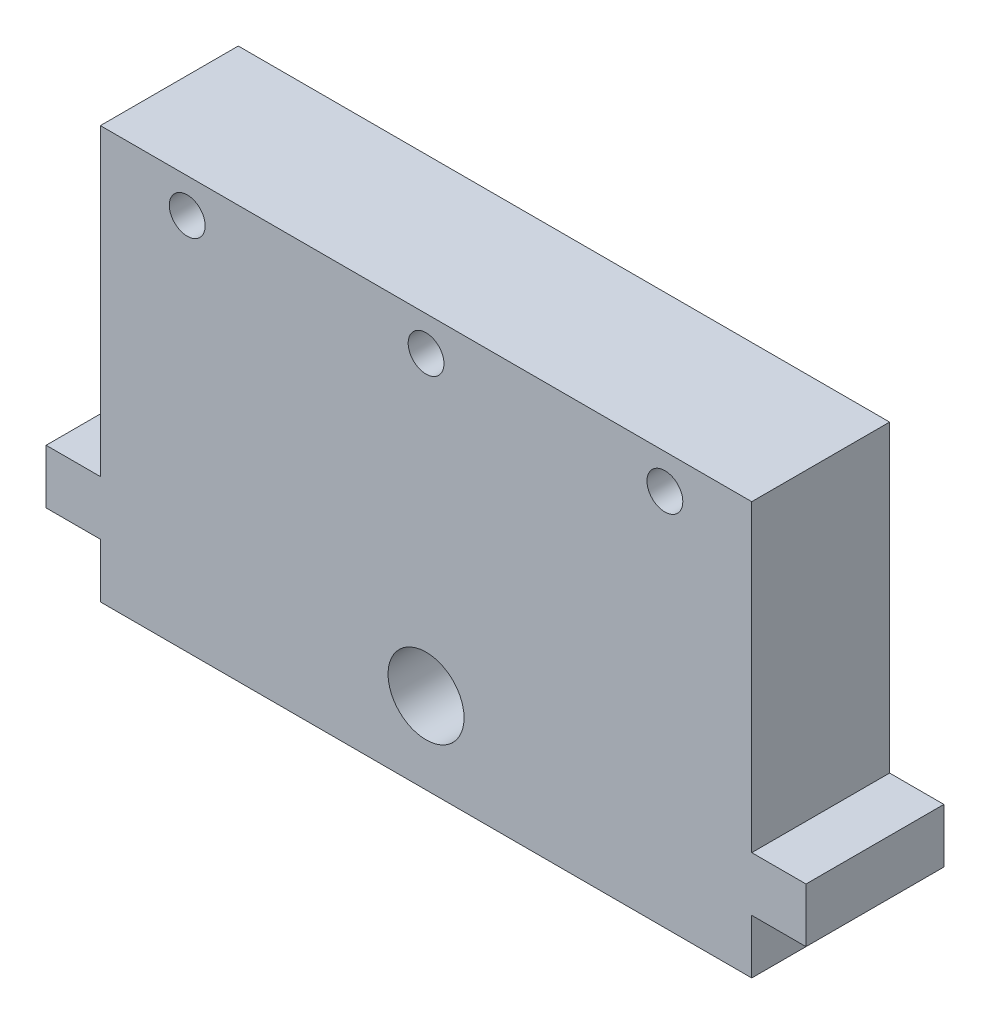
ISO-10303-21;
HEADER;
FILE_DESCRIPTION(('STEP AP214'),'2;1');
FILE_NAME('part.step','',(''),(''),'','','');
FILE_SCHEMA(('AUTOMOTIVE_DESIGN { 1 0 10303 214 1 1 1 1 }'));
ENDSEC;
DATA;
#1=APPLICATION_CONTEXT('core data for automotive mechanical design processes');
#2=APPLICATION_PROTOCOL_DEFINITION('international standard','automotive_design',2000,#1);
#3=PRODUCT_CONTEXT('',#1,'mechanical');
#4=PRODUCT('Part','Part','',(#3));
#5=PRODUCT_RELATED_PRODUCT_CATEGORY('part','',(#4));
#6=PRODUCT_DEFINITION_FORMATION('','',#4);
#7=PRODUCT_DEFINITION_CONTEXT('part definition',#1,'design');
#8=PRODUCT_DEFINITION('design','',#6,#7);
#9=PRODUCT_DEFINITION_SHAPE('','',#8);
#10=(LENGTH_UNIT() NAMED_UNIT(*) SI_UNIT(.MILLI.,.METRE.));
#11=(NAMED_UNIT(*) PLANE_ANGLE_UNIT() SI_UNIT($,.RADIAN.));
#12=(NAMED_UNIT(*) SI_UNIT($,.STERADIAN.) SOLID_ANGLE_UNIT());
#13=UNCERTAINTY_MEASURE_WITH_UNIT(LENGTH_MEASURE(1.E-05),#10,'distance_accuracy_value','');
#14=(GEOMETRIC_REPRESENTATION_CONTEXT(3) GLOBAL_UNCERTAINTY_ASSIGNED_CONTEXT((#13)) GLOBAL_UNIT_ASSIGNED_CONTEXT((#10,
#11,#12)) REPRESENTATION_CONTEXT('',''));
#15=CARTESIAN_POINT('',(0.,0.,0.));
#16=DIRECTION('',(0.,0.,1.));
#17=DIRECTION('',(1.,0.,0.));
#18=AXIS2_PLACEMENT_3D('',#15,#16,#17);
#19=CARTESIAN_POINT('',(0.,38.,0.));
#20=DIRECTION('',(-1.,0.,0.));
#21=DIRECTION('',(0.,0.,1.));
#22=AXIS2_PLACEMENT_3D('',#19,#20,#21);
#23=PLANE('',#22);
#24=DIRECTION('',(0.,0.,1.));
#25=VECTOR('',#24,1.);
#26=CARTESIAN_POINT('',(0.,10.,-12.7));
#27=LINE('',#26,#25);
#28=CARTESIAN_POINT('',(0.,10.,-12.7));
#29=VERTEX_POINT('',#28);
#30=CARTESIAN_POINT('',(0.,10.,0.));
#31=VERTEX_POINT('',#30);
#32=EDGE_CURVE('E142',#29,#31,#27,.T.);
#33=ORIENTED_EDGE('',*,*,#32,.F.);
#34=DIRECTION('',(0.,-1.,0.));
#35=VECTOR('',#34,1.);
#36=CARTESIAN_POINT('',(0.,38.,-12.7));
#37=LINE('',#36,#35);
#38=CARTESIAN_POINT('',(0.,38.,-12.7));
#39=VERTEX_POINT('',#38);
#40=EDGE_CURVE('E11',#39,#29,#37,.T.);
#41=ORIENTED_EDGE('',*,*,#40,.F.);
#42=DIRECTION('',(0.,0.,-1.));
#43=VECTOR('',#42,1.);
#44=CARTESIAN_POINT('',(0.,38.,0.));
#45=LINE('',#44,#43);
#46=CARTESIAN_POINT('',(0.,38.,0.));
#47=VERTEX_POINT('',#46);
#48=EDGE_CURVE('E221',#47,#39,#45,.T.);
#49=ORIENTED_EDGE('',*,*,#48,.F.);
#50=DIRECTION('',(0.,-1.,0.));
#51=VECTOR('',#50,1.);
#52=CARTESIAN_POINT('',(0.,38.,0.));
#53=LINE('',#52,#51);
#54=EDGE_CURVE('E249',#47,#31,#53,.T.);
#55=ORIENTED_EDGE('',*,*,#54,.T.);
#56=EDGE_LOOP('',(#33,#41,#49,#55));
#57=FACE_BOUND('',#56,.T.);
#58=ADVANCED_FACE('F41',(#57),#23,.F.);
#59=CARTESIAN_POINT('',(-60.,38.,0.));
#60=DIRECTION('',(1.,0.,0.));
#61=DIRECTION('',(0.,0.,-1.));
#62=AXIS2_PLACEMENT_3D('',#59,#60,#61);
#63=PLANE('',#62);
#64=DIRECTION('',(0.,0.,1.));
#65=VECTOR('',#64,1.);
#66=CARTESIAN_POINT('',(-60.,5.,-12.7));
#67=LINE('',#66,#65);
#68=CARTESIAN_POINT('',(-60.,5.,-12.7));
#69=VERTEX_POINT('',#68);
#70=CARTESIAN_POINT('',(-60.,5.,0.));
#71=VERTEX_POINT('',#70);
#72=EDGE_CURVE('E201',#69,#71,#67,.T.);
#73=ORIENTED_EDGE('',*,*,#72,.F.);
#74=DIRECTION('',(0.,-1.,0.));
#75=VECTOR('',#74,1.);
#76=CARTESIAN_POINT('',(-60.,38.,-12.7));
#77=LINE('',#76,#75);
#78=CARTESIAN_POINT('',(-60.,0.,-12.7));
#79=VERTEX_POINT('',#78);
#80=EDGE_CURVE('E257',#69,#79,#77,.T.);
#81=ORIENTED_EDGE('',*,*,#80,.T.);
#82=DIRECTION('',(0.,0.,1.));
#83=VECTOR('',#82,1.);
#84=CARTESIAN_POINT('',(-60.,0.,0.));
#85=LINE('',#84,#83);
#86=CARTESIAN_POINT('',(-60.,0.,0.));
#87=VERTEX_POINT('',#86);
#88=EDGE_CURVE('E242',#79,#87,#85,.T.);
#89=ORIENTED_EDGE('',*,*,#88,.T.);
#90=DIRECTION('',(0.,-1.,0.));
#91=VECTOR('',#90,1.);
#92=CARTESIAN_POINT('',(-60.,38.,0.));
#93=LINE('',#92,#91);
#94=EDGE_CURVE('E253',#71,#87,#93,.T.);
#95=ORIENTED_EDGE('',*,*,#94,.F.);
#96=EDGE_LOOP('',(#73,#81,#89,#95));
#97=FACE_BOUND('',#96,.T.);
#98=ADVANCED_FACE('F269',(#97),#63,.F.);
#99=CARTESIAN_POINT('',(0.,5.,-12.7));
#100=VERTEX_POINT('',#99);
#101=CARTESIAN_POINT('',(0.,0.,-12.7));
#102=VERTEX_POINT('',#101);
#103=EDGE_CURVE('E50',#100,#102,#37,.T.);
#104=ORIENTED_EDGE('',*,*,#103,.F.);
#105=DIRECTION('',(0.,0.,1.));
#106=VECTOR('',#105,1.);
#107=CARTESIAN_POINT('',(0.,5.,-12.7));
#108=LINE('',#107,#106);
#109=CARTESIAN_POINT('',(0.,5.,0.));
#110=VERTEX_POINT('',#109);
#111=EDGE_CURVE('E174',#100,#110,#108,.T.);
#112=ORIENTED_EDGE('',*,*,#111,.T.);
#113=CARTESIAN_POINT('',(0.,0.,0.));
#114=VERTEX_POINT('',#113);
#115=EDGE_CURVE('E235',#110,#114,#53,.T.);
#116=ORIENTED_EDGE('',*,*,#115,.T.);
#117=DIRECTION('',(0.,0.,-1.));
#118=VECTOR('',#117,1.);
#119=CARTESIAN_POINT('',(0.,0.,0.));
#120=LINE('',#119,#118);
#121=EDGE_CURVE('E220',#114,#102,#120,.T.);
#122=ORIENTED_EDGE('',*,*,#121,.T.);
#123=EDGE_LOOP('',(#104,#112,#116,#122));
#124=FACE_BOUND('',#123,.T.);
#125=ADVANCED_FACE('F43',(#124),#23,.F.);
#126=CARTESIAN_POINT('',(0.,38.,-12.7));
#127=DIRECTION('',(0.,0.,1.));
#128=DIRECTION('',(1.,0.,0.));
#129=AXIS2_PLACEMENT_3D('',#126,#127,#128);
#130=PLANE('',#129);
#131=CARTESIAN_POINT('',(-52.,34.825,-12.7));
#132=DIRECTION('',(0.,0.,1.));
#133=DIRECTION('',(1.,0.,0.));
#134=AXIS2_PLACEMENT_3D('',#131,#132,#133);
#135=CIRCLE('',#134,1.65);
#136=CARTESIAN_POINT('',(-50.35,34.825,-12.7));
#137=VERTEX_POINT('',#136);
#138=EDGE_CURVE('E363',#137,#137,#135,.T.);
#139=ORIENTED_EDGE('',*,*,#138,.T.);
#140=EDGE_LOOP('',(#139));
#141=FACE_BOUND('',#140,.T.);
#142=CARTESIAN_POINT('',(-30.,34.825,-12.7));
#143=DIRECTION('',(0.,0.,1.));
#144=DIRECTION('',(1.,0.,0.));
#145=AXIS2_PLACEMENT_3D('',#142,#143,#144);
#146=CIRCLE('',#145,1.65);
#147=CARTESIAN_POINT('',(-28.35,34.825,-12.7));
#148=VERTEX_POINT('',#147);
#149=EDGE_CURVE('E376',#148,#148,#146,.T.);
#150=ORIENTED_EDGE('',*,*,#149,.T.);
#151=EDGE_LOOP('',(#150));
#152=FACE_BOUND('',#151,.T.);
#153=CARTESIAN_POINT('',(-8.,34.825,-12.7));
#154=DIRECTION('',(0.,0.,1.));
#155=DIRECTION('',(1.,0.,0.));
#156=AXIS2_PLACEMENT_3D('',#153,#154,#155);
#157=CIRCLE('',#156,1.65);
#158=CARTESIAN_POINT('',(-6.35,34.825,-12.7));
#159=VERTEX_POINT('',#158);
#160=EDGE_CURVE('E162',#159,#159,#157,.T.);
#161=ORIENTED_EDGE('',*,*,#160,.T.);
#162=EDGE_LOOP('',(#161));
#163=FACE_BOUND('',#162,.T.);
#164=CARTESIAN_POINT('',(-30.,7.5,-12.7));
#165=DIRECTION('',(0.,0.,1.));
#166=DIRECTION('',(1.,0.,0.));
#167=AXIS2_PLACEMENT_3D('',#164,#165,#166);
#168=CIRCLE('',#167,3.5);
#169=CARTESIAN_POINT('',(-26.5,7.5,-12.7));
#170=VERTEX_POINT('',#169);
#171=EDGE_CURVE('E216',#170,#170,#168,.T.);
#172=ORIENTED_EDGE('',*,*,#171,.T.);
#173=EDGE_LOOP('',(#172));
#174=FACE_BOUND('',#173,.T.);
#175=DIRECTION('',(-1.,0.,0.));
#176=VECTOR('',#175,1.);
#177=CARTESIAN_POINT('',(0.,0.,-12.7));
#178=LINE('',#177,#176);
#179=EDGE_CURVE('E239',#102,#79,#178,.T.);
#180=ORIENTED_EDGE('',*,*,#179,.T.);
#181=ORIENTED_EDGE('',*,*,#80,.F.);
#182=DIRECTION('',(1.,0.,0.));
#183=VECTOR('',#182,1.);
#184=CARTESIAN_POINT('',(-65.,5.,-12.7));
#185=LINE('',#184,#183);
#186=CARTESIAN_POINT('',(-65.,5.,-12.7));
#187=VERTEX_POINT('',#186);
#188=EDGE_CURVE('E188',#187,#69,#185,.T.);
#189=ORIENTED_EDGE('',*,*,#188,.F.);
#190=DIRECTION('',(0.,-1.,0.));
#191=VECTOR('',#190,1.);
#192=CARTESIAN_POINT('',(-65.,10.,-12.7));
#193=LINE('',#192,#191);
#194=CARTESIAN_POINT('',(-65.,10.,-12.7));
#195=VERTEX_POINT('',#194);
#196=EDGE_CURVE('E183',#195,#187,#193,.T.);
#197=ORIENTED_EDGE('',*,*,#196,.F.);
#198=DIRECTION('',(-1.,0.,0.));
#199=VECTOR('',#198,1.);
#200=CARTESIAN_POINT('',(-60.,10.,-12.7));
#201=LINE('',#200,#199);
#202=CARTESIAN_POINT('',(-60.,10.,-12.7));
#203=VERTEX_POINT('',#202);
#204=EDGE_CURVE('E179',#203,#195,#201,.T.);
#205=ORIENTED_EDGE('',*,*,#204,.F.);
#206=CARTESIAN_POINT('',(-60.,38.,-12.7));
#207=VERTEX_POINT('',#206);
#208=EDGE_CURVE('E258',#207,#203,#77,.T.);
#209=ORIENTED_EDGE('',*,*,#208,.F.);
#210=DIRECTION('',(-1.,0.,0.));
#211=VECTOR('',#210,1.);
#212=CARTESIAN_POINT('',(0.,38.,-12.7));
#213=LINE('',#212,#211);
#214=EDGE_CURVE('E225',#39,#207,#213,.T.);
#215=ORIENTED_EDGE('',*,*,#214,.F.);
#216=ORIENTED_EDGE('',*,*,#40,.T.);
#217=DIRECTION('',(-1.,0.,0.));
#218=VECTOR('',#217,1.);
#219=CARTESIAN_POINT('',(0.,10.,-12.7));
#220=LINE('',#219,#218);
#221=CARTESIAN_POINT('',(5.,10.,-12.7));
#222=VERTEX_POINT('',#221);
#223=EDGE_CURVE('E133',#222,#29,#220,.T.);
#224=ORIENTED_EDGE('',*,*,#223,.F.);
#225=DIRECTION('',(0.,1.,0.));
#226=VECTOR('',#225,1.);
#227=CARTESIAN_POINT('',(5.,10.,-12.7));
#228=LINE('',#227,#226);
#229=CARTESIAN_POINT('',(5.,5.,-12.7));
#230=VERTEX_POINT('',#229);
#231=EDGE_CURVE('E150',#230,#222,#228,.T.);
#232=ORIENTED_EDGE('',*,*,#231,.F.);
#233=DIRECTION('',(1.,0.,0.));
#234=VECTOR('',#233,1.);
#235=CARTESIAN_POINT('',(5.,5.,-12.7));
#236=LINE('',#235,#234);
#237=EDGE_CURVE('E143',#100,#230,#236,.T.);
#238=ORIENTED_EDGE('',*,*,#237,.F.);
#239=ORIENTED_EDGE('',*,*,#103,.T.);
#240=EDGE_LOOP('',(#180,#181,#189,#197,#205,#209,#215,#216,#224,#232,#238,#239));
#241=FACE_BOUND('',#240,.T.);
#242=ADVANCED_FACE('F148',(#141,#152,#163,#174,#241),#130,.F.);
#243=ORIENTED_EDGE('',*,*,#208,.T.);
#244=DIRECTION('',(0.,0.,1.));
#245=VECTOR('',#244,1.);
#246=CARTESIAN_POINT('',(-60.,10.,-12.7));
#247=LINE('',#246,#245);
#248=CARTESIAN_POINT('',(-60.,10.,0.));
#249=VERTEX_POINT('',#248);
#250=EDGE_CURVE('E191',#203,#249,#247,.T.);
#251=ORIENTED_EDGE('',*,*,#250,.T.);
#252=CARTESIAN_POINT('',(-60.,38.,0.));
#253=VERTEX_POINT('',#252);
#254=EDGE_CURVE('E254',#253,#249,#93,.T.);
#255=ORIENTED_EDGE('',*,*,#254,.F.);
#256=DIRECTION('',(0.,0.,1.));
#257=VECTOR('',#256,1.);
#258=CARTESIAN_POINT('',(-60.,38.,0.));
#259=LINE('',#258,#257);
#260=EDGE_CURVE('E229',#207,#253,#259,.T.);
#261=ORIENTED_EDGE('',*,*,#260,.F.);
#262=EDGE_LOOP('',(#243,#251,#255,#261));
#263=FACE_BOUND('',#262,.T.);
#264=ADVANCED_FACE('F294',(#263),#63,.F.);
#265=CARTESIAN_POINT('',(0.,38.,0.));
#266=DIRECTION('',(0.,0.,-1.));
#267=DIRECTION('',(-1.,0.,0.));
#268=AXIS2_PLACEMENT_3D('',#265,#266,#267);
#269=PLANE('',#268);
#270=CARTESIAN_POINT('',(-52.,34.825,0.));
#271=DIRECTION('',(0.,0.,1.));
#272=DIRECTION('',(1.,0.,0.));
#273=AXIS2_PLACEMENT_3D('',#270,#271,#272);
#274=CIRCLE('',#273,1.65);
#275=CARTESIAN_POINT('',(-50.35,34.825,0.));
#276=VERTEX_POINT('',#275);
#277=EDGE_CURVE('E366',#276,#276,#274,.T.);
#278=ORIENTED_EDGE('',*,*,#277,.F.);
#279=EDGE_LOOP('',(#278));
#280=FACE_BOUND('',#279,.T.);
#281=CARTESIAN_POINT('',(-30.,34.825,0.));
#282=DIRECTION('',(0.,0.,1.));
#283=DIRECTION('',(1.,0.,0.));
#284=AXIS2_PLACEMENT_3D('',#281,#282,#283);
#285=CIRCLE('',#284,1.65);
#286=CARTESIAN_POINT('',(-28.35,34.825,0.));
#287=VERTEX_POINT('',#286);
#288=EDGE_CURVE('E370',#287,#287,#285,.T.);
#289=ORIENTED_EDGE('',*,*,#288,.F.);
#290=EDGE_LOOP('',(#289));
#291=FACE_BOUND('',#290,.T.);
#292=CARTESIAN_POINT('',(-8.,34.825,0.));
#293=DIRECTION('',(0.,0.,1.));
#294=DIRECTION('',(1.,0.,0.));
#295=AXIS2_PLACEMENT_3D('',#292,#293,#294);
#296=CIRCLE('',#295,1.65);
#297=CARTESIAN_POINT('',(-6.35,34.825,0.));
#298=VERTEX_POINT('',#297);
#299=EDGE_CURVE('E379',#298,#298,#296,.T.);
#300=ORIENTED_EDGE('',*,*,#299,.F.);
#301=EDGE_LOOP('',(#300));
#302=FACE_BOUND('',#301,.T.);
#303=CARTESIAN_POINT('',(-30.,7.5,0.));
#304=DIRECTION('',(0.,0.,1.));
#305=DIRECTION('',(1.,0.,0.));
#306=AXIS2_PLACEMENT_3D('',#303,#304,#305);
#307=CIRCLE('',#306,3.5);
#308=CARTESIAN_POINT('',(-26.5,7.5,0.));
#309=VERTEX_POINT('',#308);
#310=EDGE_CURVE('E204',#309,#309,#307,.T.);
#311=ORIENTED_EDGE('',*,*,#310,.F.);
#312=EDGE_LOOP('',(#311));
#313=FACE_BOUND('',#312,.T.);
#314=DIRECTION('',(1.,0.,0.));
#315=VECTOR('',#314,1.);
#316=CARTESIAN_POINT('',(0.,0.,0.));
#317=LINE('',#316,#315);
#318=EDGE_CURVE('E226',#87,#114,#317,.T.);
#319=ORIENTED_EDGE('',*,*,#318,.T.);
#320=ORIENTED_EDGE('',*,*,#115,.F.);
#321=DIRECTION('',(1.,0.,0.));
#322=VECTOR('',#321,1.);
#323=CARTESIAN_POINT('',(5.,5.,0.));
#324=LINE('',#323,#322);
#325=CARTESIAN_POINT('',(5.,5.,0.));
#326=VERTEX_POINT('',#325);
#327=EDGE_CURVE('E57',#110,#326,#324,.T.);
#328=ORIENTED_EDGE('',*,*,#327,.T.);
#329=DIRECTION('',(0.,1.,0.));
#330=VECTOR('',#329,1.);
#331=CARTESIAN_POINT('',(5.,10.,0.));
#332=LINE('',#331,#330);
#333=CARTESIAN_POINT('',(5.,10.,0.));
#334=VERTEX_POINT('',#333);
#335=EDGE_CURVE('E167',#326,#334,#332,.T.);
#336=ORIENTED_EDGE('',*,*,#335,.T.);
#337=DIRECTION('',(-1.,0.,0.));
#338=VECTOR('',#337,1.);
#339=CARTESIAN_POINT('',(0.,10.,0.));
#340=LINE('',#339,#338);
#341=EDGE_CURVE('E136',#334,#31,#340,.T.);
#342=ORIENTED_EDGE('',*,*,#341,.T.);
#343=ORIENTED_EDGE('',*,*,#54,.F.);
#344=DIRECTION('',(1.,0.,0.));
#345=VECTOR('',#344,1.);
#346=CARTESIAN_POINT('',(0.,38.,0.));
#347=LINE('',#346,#345);
#348=EDGE_CURVE('E232',#253,#47,#347,.T.);
#349=ORIENTED_EDGE('',*,*,#348,.F.);
#350=ORIENTED_EDGE('',*,*,#254,.T.);
#351=DIRECTION('',(-1.,0.,0.));
#352=VECTOR('',#351,1.);
#353=CARTESIAN_POINT('',(-60.,10.,0.));
#354=LINE('',#353,#352);
#355=CARTESIAN_POINT('',(-65.,10.,0.));
#356=VERTEX_POINT('',#355);
#357=EDGE_CURVE('E65',#249,#356,#354,.T.);
#358=ORIENTED_EDGE('',*,*,#357,.T.);
#359=DIRECTION('',(0.,-1.,0.));
#360=VECTOR('',#359,1.);
#361=CARTESIAN_POINT('',(-65.,10.,0.));
#362=LINE('',#361,#360);
#363=CARTESIAN_POINT('',(-65.,5.,0.));
#364=VERTEX_POINT('',#363);
#365=EDGE_CURVE('E194',#356,#364,#362,.T.);
#366=ORIENTED_EDGE('',*,*,#365,.T.);
#367=DIRECTION('',(1.,0.,0.));
#368=VECTOR('',#367,1.);
#369=CARTESIAN_POINT('',(-65.,5.,0.));
#370=LINE('',#369,#368);
#371=EDGE_CURVE('E184',#364,#71,#370,.T.);
#372=ORIENTED_EDGE('',*,*,#371,.T.);
#373=ORIENTED_EDGE('',*,*,#94,.T.);
#374=EDGE_LOOP('',(#319,#320,#328,#336,#342,#343,#349,#350,#358,#366,#372,#373));
#375=FACE_BOUND('',#374,.T.);
#376=ADVANCED_FACE('F281',(#280,#291,#302,#313,#375),#269,.F.);
#377=CARTESIAN_POINT('',(0.,38.,0.));
#378=DIRECTION('',(0.,1.,0.));
#379=DIRECTION('',(0.,0.,1.));
#380=AXIS2_PLACEMENT_3D('',#377,#378,#379);
#381=PLANE('',#380);
#382=ORIENTED_EDGE('',*,*,#48,.T.);
#383=ORIENTED_EDGE('',*,*,#214,.T.);
#384=ORIENTED_EDGE('',*,*,#260,.T.);
#385=ORIENTED_EDGE('',*,*,#348,.T.);
#386=EDGE_LOOP('',(#382,#383,#384,#385));
#387=FACE_BOUND('',#386,.T.);
#388=ADVANCED_FACE('F292',(#387),#381,.T.);
#389=CARTESIAN_POINT('',(0.,0.,0.));
#390=DIRECTION('',(0.,1.,0.));
#391=DIRECTION('',(0.,0.,1.));
#392=AXIS2_PLACEMENT_3D('',#389,#390,#391);
#393=PLANE('',#392);
#394=ORIENTED_EDGE('',*,*,#121,.F.);
#395=ORIENTED_EDGE('',*,*,#318,.F.);
#396=ORIENTED_EDGE('',*,*,#88,.F.);
#397=ORIENTED_EDGE('',*,*,#179,.F.);
#398=EDGE_LOOP('',(#394,#395,#396,#397));
#399=FACE_BOUND('',#398,.T.);
#400=ADVANCED_FACE('F278',(#399),#393,.F.);
#401=CARTESIAN_POINT('',(-30.,7.5,0.));
#402=DIRECTION('',(0.,0.,1.));
#403=DIRECTION('',(1.,0.,0.));
#404=AXIS2_PLACEMENT_3D('',#401,#402,#403);
#405=CYLINDRICAL_SURFACE('',#404,3.5);
#406=ORIENTED_EDGE('',*,*,#310,.T.);
#407=EDGE_LOOP('',(#406));
#408=FACE_BOUND('',#407,.T.);
#409=ORIENTED_EDGE('',*,*,#171,.F.);
#410=EDGE_LOOP('',(#409));
#411=FACE_BOUND('',#410,.T.);
#412=ADVANCED_FACE('F304',(#408,#411),#405,.F.);
#413=CARTESIAN_POINT('',(-65.,5.,-12.7));
#414=DIRECTION('',(0.,-1.,0.));
#415=DIRECTION('',(1.,0.,0.));
#416=AXIS2_PLACEMENT_3D('',#413,#414,#415);
#417=PLANE('',#416);
#418=ORIENTED_EDGE('',*,*,#371,.F.);
#419=DIRECTION('',(0.,0.,1.));
#420=VECTOR('',#419,1.);
#421=CARTESIAN_POINT('',(-65.,5.,-12.7));
#422=LINE('',#421,#420);
#423=EDGE_CURVE('E205',#187,#364,#422,.T.);
#424=ORIENTED_EDGE('',*,*,#423,.F.);
#425=ORIENTED_EDGE('',*,*,#188,.T.);
#426=ORIENTED_EDGE('',*,*,#72,.T.);
#427=EDGE_LOOP('',(#418,#424,#425,#426));
#428=FACE_BOUND('',#427,.T.);
#429=ADVANCED_FACE('F302',(#428),#417,.T.);
#430=CARTESIAN_POINT('',(-65.,10.,-12.7));
#431=DIRECTION('',(-1.,0.,0.));
#432=DIRECTION('',(0.,0.,1.));
#433=AXIS2_PLACEMENT_3D('',#430,#431,#432);
#434=PLANE('',#433);
#435=ORIENTED_EDGE('',*,*,#365,.F.);
#436=DIRECTION('',(0.,0.,1.));
#437=VECTOR('',#436,1.);
#438=CARTESIAN_POINT('',(-65.,10.,-12.7));
#439=LINE('',#438,#437);
#440=EDGE_CURVE('E208',#195,#356,#439,.T.);
#441=ORIENTED_EDGE('',*,*,#440,.F.);
#442=ORIENTED_EDGE('',*,*,#196,.T.);
#443=ORIENTED_EDGE('',*,*,#423,.T.);
#444=EDGE_LOOP('',(#435,#441,#442,#443));
#445=FACE_BOUND('',#444,.T.);
#446=ADVANCED_FACE('F300',(#445),#434,.T.);
#447=CARTESIAN_POINT('',(-60.,10.,-12.7));
#448=DIRECTION('',(0.,1.,0.));
#449=DIRECTION('',(0.,0.,1.));
#450=AXIS2_PLACEMENT_3D('',#447,#448,#449);
#451=PLANE('',#450);
#452=ORIENTED_EDGE('',*,*,#357,.F.);
#453=ORIENTED_EDGE('',*,*,#250,.F.);
#454=ORIENTED_EDGE('',*,*,#204,.T.);
#455=ORIENTED_EDGE('',*,*,#440,.T.);
#456=EDGE_LOOP('',(#452,#453,#454,#455));
#457=FACE_BOUND('',#456,.T.);
#458=ADVANCED_FACE('F296',(#457),#451,.T.);
#459=CARTESIAN_POINT('',(5.,10.,-12.7));
#460=DIRECTION('',(1.,0.,0.));
#461=DIRECTION('',(0.,0.,-1.));
#462=AXIS2_PLACEMENT_3D('',#459,#460,#461);
#463=PLANE('',#462);
#464=ORIENTED_EDGE('',*,*,#335,.F.);
#465=DIRECTION('',(0.,0.,1.));
#466=VECTOR('',#465,1.);
#467=CARTESIAN_POINT('',(5.,5.,-12.7));
#468=LINE('',#467,#466);
#469=EDGE_CURVE('E156',#230,#326,#468,.T.);
#470=ORIENTED_EDGE('',*,*,#469,.F.);
#471=ORIENTED_EDGE('',*,*,#231,.T.);
#472=DIRECTION('',(0.,0.,1.));
#473=VECTOR('',#472,1.);
#474=CARTESIAN_POINT('',(5.,10.,-12.7));
#475=LINE('',#474,#473);
#476=EDGE_CURVE('E130',#222,#334,#475,.T.);
#477=ORIENTED_EDGE('',*,*,#476,.T.);
#478=EDGE_LOOP('',(#464,#470,#471,#477));
#479=FACE_BOUND('',#478,.T.);
#480=ADVANCED_FACE('F155',(#479),#463,.T.);
#481=CARTESIAN_POINT('',(5.,5.,-12.7));
#482=DIRECTION('',(0.,-1.,0.));
#483=DIRECTION('',(1.,0.,0.));
#484=AXIS2_PLACEMENT_3D('',#481,#482,#483);
#485=PLANE('',#484);
#486=ORIENTED_EDGE('',*,*,#327,.F.);
#487=ORIENTED_EDGE('',*,*,#111,.F.);
#488=ORIENTED_EDGE('',*,*,#237,.T.);
#489=ORIENTED_EDGE('',*,*,#469,.T.);
#490=EDGE_LOOP('',(#486,#487,#488,#489));
#491=FACE_BOUND('',#490,.T.);
#492=ADVANCED_FACE('F286',(#491),#485,.T.);
#493=CARTESIAN_POINT('',(0.,10.,-12.7));
#494=DIRECTION('',(0.,1.,0.));
#495=DIRECTION('',(0.,0.,1.));
#496=AXIS2_PLACEMENT_3D('',#493,#494,#495);
#497=PLANE('',#496);
#498=ORIENTED_EDGE('',*,*,#341,.F.);
#499=ORIENTED_EDGE('',*,*,#476,.F.);
#500=ORIENTED_EDGE('',*,*,#223,.T.);
#501=ORIENTED_EDGE('',*,*,#32,.T.);
#502=EDGE_LOOP('',(#498,#499,#500,#501));
#503=FACE_BOUND('',#502,.T.);
#504=ADVANCED_FACE('F132',(#503),#497,.T.);
#505=CARTESIAN_POINT('',(-8.,34.825,0.));
#506=DIRECTION('',(0.,0.,1.));
#507=DIRECTION('',(1.,0.,0.));
#508=AXIS2_PLACEMENT_3D('',#505,#506,#507);
#509=CYLINDRICAL_SURFACE('',#508,1.65);
#510=ORIENTED_EDGE('',*,*,#160,.F.);
#511=EDGE_LOOP('',(#510));
#512=FACE_BOUND('',#511,.T.);
#513=ORIENTED_EDGE('',*,*,#299,.T.);
#514=EDGE_LOOP('',(#513));
#515=FACE_BOUND('',#514,.T.);
#516=ADVANCED_FACE('F347',(#512,#515),#509,.F.);
#517=CARTESIAN_POINT('',(-30.,34.825,0.));
#518=DIRECTION('',(0.,0.,1.));
#519=DIRECTION('',(1.,0.,0.));
#520=AXIS2_PLACEMENT_3D('',#517,#518,#519);
#521=CYLINDRICAL_SURFACE('',#520,1.65);
#522=ORIENTED_EDGE('',*,*,#149,.F.);
#523=EDGE_LOOP('',(#522));
#524=FACE_BOUND('',#523,.T.);
#525=ORIENTED_EDGE('',*,*,#288,.T.);
#526=EDGE_LOOP('',(#525));
#527=FACE_BOUND('',#526,.T.);
#528=ADVANCED_FACE('F351',(#524,#527),#521,.F.);
#529=CARTESIAN_POINT('',(-52.,34.825,0.));
#530=DIRECTION('',(0.,0.,1.));
#531=DIRECTION('',(1.,0.,0.));
#532=AXIS2_PLACEMENT_3D('',#529,#530,#531);
#533=CYLINDRICAL_SURFACE('',#532,1.65);
#534=ORIENTED_EDGE('',*,*,#138,.F.);
#535=EDGE_LOOP('',(#534));
#536=FACE_BOUND('',#535,.T.);
#537=ORIENTED_EDGE('',*,*,#277,.T.);
#538=EDGE_LOOP('',(#537));
#539=FACE_BOUND('',#538,.T.);
#540=ADVANCED_FACE('F355',(#536,#539),#533,.F.);
#541=CLOSED_SHELL('',(#58,#98,#125,#242,#264,#376,#388,#400,#412,#429,#446,#458,#480,#492,#504,
#516,#528,#540));
#542=MANIFOLD_SOLID_BREP('B2',#541);
#543=ADVANCED_BREP_SHAPE_REPRESENTATION('',(#18,#542),#14);
#544=SHAPE_DEFINITION_REPRESENTATION(#9,#543);
ENDSEC;
END-ISO-10303-21;
